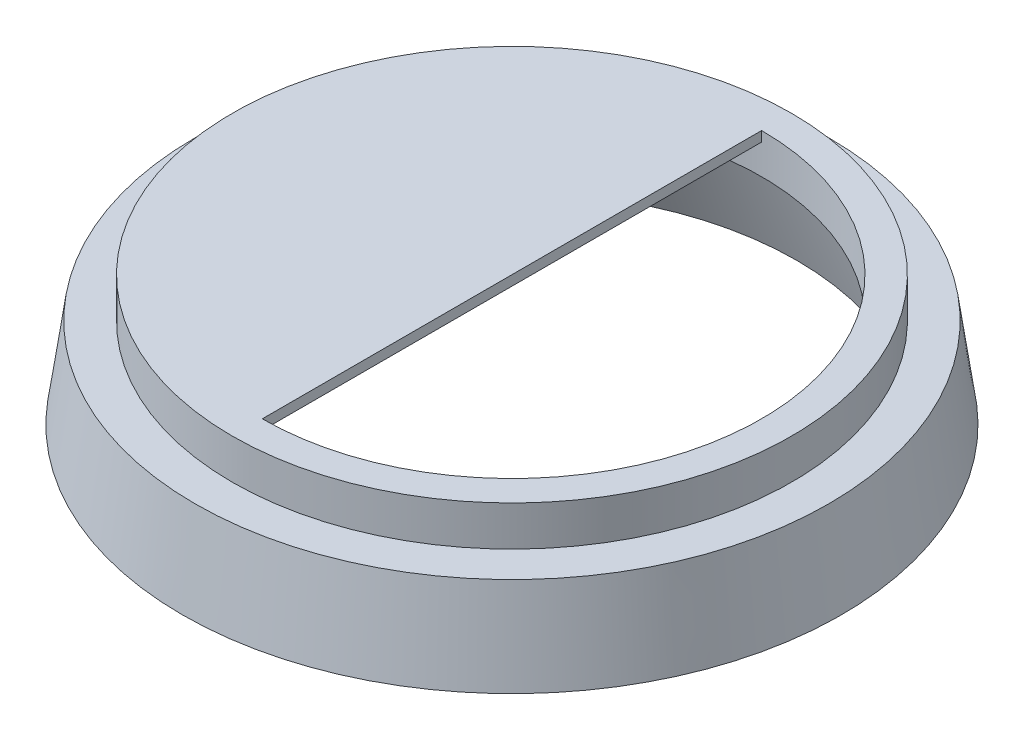
ISO-10303-21;
HEADER;
FILE_DESCRIPTION(('STEP AP214'),'2;1');
FILE_NAME('part.step','',(''),(''),'','','');
FILE_SCHEMA(('AUTOMOTIVE_DESIGN { 1 0 10303 214 1 1 1 1 }'));
ENDSEC;
DATA;
#1=APPLICATION_CONTEXT('core data for automotive mechanical design processes');
#2=APPLICATION_PROTOCOL_DEFINITION('international standard','automotive_design',2000,#1);
#3=PRODUCT_CONTEXT('',#1,'mechanical');
#4=PRODUCT('Part','Part','',(#3));
#5=PRODUCT_RELATED_PRODUCT_CATEGORY('part','',(#4));
#6=PRODUCT_DEFINITION_FORMATION('','',#4);
#7=PRODUCT_DEFINITION_CONTEXT('part definition',#1,'design');
#8=PRODUCT_DEFINITION('design','',#6,#7);
#9=PRODUCT_DEFINITION_SHAPE('','',#8);
#10=(LENGTH_UNIT() NAMED_UNIT(*) SI_UNIT(.MILLI.,.METRE.));
#11=(NAMED_UNIT(*) PLANE_ANGLE_UNIT() SI_UNIT($,.RADIAN.));
#12=(NAMED_UNIT(*) SI_UNIT($,.STERADIAN.) SOLID_ANGLE_UNIT());
#13=UNCERTAINTY_MEASURE_WITH_UNIT(LENGTH_MEASURE(1.E-05),#10,'distance_accuracy_value','');
#14=(GEOMETRIC_REPRESENTATION_CONTEXT(3) GLOBAL_UNCERTAINTY_ASSIGNED_CONTEXT((#13)) GLOBAL_UNIT_ASSIGNED_CONTEXT((#10,
#11,#12)) REPRESENTATION_CONTEXT('',''));
#15=CARTESIAN_POINT('',(0.,0.,0.));
#16=DIRECTION('',(0.,0.,1.));
#17=DIRECTION('',(1.,0.,0.));
#18=AXIS2_PLACEMENT_3D('',#15,#16,#17);
#19=CARTESIAN_POINT('',(0.,0.,0.));
#20=DIRECTION('',(0.,-1.,0.));
#21=DIRECTION('',(0.,0.,1.));
#22=AXIS2_PLACEMENT_3D('',#19,#20,#21);
#23=CONICAL_SURFACE('',#22,16.5,0.139626340159547);
#24=CARTESIAN_POINT('',(0.,0.,0.));
#25=DIRECTION('',(0.,1.,0.));
#26=DIRECTION('',(0.,0.,1.));
#27=AXIS2_PLACEMENT_3D('',#24,#25,#26);
#28=CIRCLE('',#27,16.5);
#29=CARTESIAN_POINT('',(0.,0.,16.5));
#30=VERTEX_POINT('',#29);
#31=EDGE_CURVE('E111',#30,#30,#28,.T.);
#32=ORIENTED_EDGE('',*,*,#31,.T.);
#33=EDGE_LOOP('',(#32));
#34=FACE_BOUND('',#33,.T.);
#35=CARTESIAN_POINT('',(0.,4.5,0.));
#36=DIRECTION('',(0.,1.,0.));
#37=DIRECTION('',(0.,0.,1.));
#38=AXIS2_PLACEMENT_3D('',#35,#36,#37);
#39=CIRCLE('',#38,15.8675662438392);
#40=CARTESIAN_POINT('',(0.,4.5,15.8675662438392));
#41=VERTEX_POINT('',#40);
#42=EDGE_CURVE('E43',#41,#41,#39,.T.);
#43=ORIENTED_EDGE('',*,*,#42,.F.);
#44=EDGE_LOOP('',(#43));
#45=FACE_BOUND('',#44,.T.);
#46=ADVANCED_FACE('F39',(#34,#45),#23,.T.);
#47=CARTESIAN_POINT('',(0.,6.5,0.));
#48=DIRECTION('',(0.,1.,0.));
#49=DIRECTION('',(0.,0.,1.));
#50=AXIS2_PLACEMENT_3D('',#47,#48,#49);
#51=PLANE('',#50);
#52=CARTESIAN_POINT('',(0.,6.5,0.));
#53=DIRECTION('',(0.,1.,0.));
#54=DIRECTION('',(0.,0.,1.));
#55=AXIS2_PLACEMENT_3D('',#52,#53,#54);
#56=CIRCLE('',#55,12.5);
#57=CARTESIAN_POINT('',(0.,6.5,12.5));
#58=VERTEX_POINT('',#57);
#59=CARTESIAN_POINT('',(0.,6.5,-12.5));
#60=VERTEX_POINT('',#59);
#61=EDGE_CURVE('E76',#58,#60,#56,.T.);
#62=ORIENTED_EDGE('',*,*,#61,.F.);
#63=DIRECTION('',(0.,0.,1.));
#64=VECTOR('',#63,1.);
#65=CARTESIAN_POINT('',(0.,6.5,12.5));
#66=LINE('',#65,#64);
#67=EDGE_CURVE('E86',#60,#58,#66,.T.);
#68=ORIENTED_EDGE('',*,*,#67,.F.);
#69=EDGE_LOOP('',(#62,#68));
#70=FACE_BOUND('',#69,.T.);
#71=CARTESIAN_POINT('',(0.,6.5,0.));
#72=DIRECTION('',(0.,1.,0.));
#73=DIRECTION('',(0.,0.,1.));
#74=AXIS2_PLACEMENT_3D('',#71,#72,#73);
#75=CIRCLE('',#74,14.);
#76=CARTESIAN_POINT('',(0.,6.5,14.));
#77=VERTEX_POINT('',#76);
#78=EDGE_CURVE('E99',#77,#77,#75,.T.);
#79=ORIENTED_EDGE('',*,*,#78,.T.);
#80=EDGE_LOOP('',(#79));
#81=FACE_BOUND('',#80,.T.);
#82=ADVANCED_FACE('F91',(#70,#81),#51,.T.);
#83=CARTESIAN_POINT('',(0.,0.,0.));
#84=DIRECTION('',(0.,1.,0.));
#85=DIRECTION('',(0.,0.,1.));
#86=AXIS2_PLACEMENT_3D('',#83,#84,#85);
#87=PLANE('',#86);
#88=CARTESIAN_POINT('',(0.,0.,0.));
#89=DIRECTION('',(0.,-1.,0.));
#90=DIRECTION('',(0.,0.,-1.));
#91=AXIS2_PLACEMENT_3D('',#88,#89,#90);
#92=CIRCLE('',#91,14.25);
#93=CARTESIAN_POINT('',(0.,0.,-14.25));
#94=VERTEX_POINT('',#93);
#95=EDGE_CURVE('E83',#94,#94,#92,.T.);
#96=ORIENTED_EDGE('',*,*,#95,.F.);
#97=EDGE_LOOP('',(#96));
#98=FACE_BOUND('',#97,.T.);
#99=ORIENTED_EDGE('',*,*,#31,.F.);
#100=EDGE_LOOP('',(#99));
#101=FACE_BOUND('',#100,.T.);
#102=ADVANCED_FACE('F135',(#98,#101),#87,.F.);
#103=CARTESIAN_POINT('',(0.,0.,0.));
#104=DIRECTION('',(0.,-1.,0.));
#105=DIRECTION('',(0.,0.,-1.));
#106=AXIS2_PLACEMENT_3D('',#103,#104,#105);
#107=CONICAL_SURFACE('',#106,14.25,0.36651914291881);
#108=CARTESIAN_POINT('',(0.,4.5,0.));
#109=DIRECTION('',(0.,-1.,0.));
#110=DIRECTION('',(0.,0.,-1.));
#111=AXIS2_PLACEMENT_3D('',#108,#109,#110);
#112=CIRCLE('',#111,12.5226118423406);
#113=CARTESIAN_POINT('',(0.,4.5,-12.5226118423406));
#114=VERTEX_POINT('',#113);
#115=EDGE_CURVE('E107',#114,#114,#112,.T.);
#116=ORIENTED_EDGE('',*,*,#115,.F.);
#117=EDGE_LOOP('',(#116));
#118=FACE_BOUND('',#117,.T.);
#119=ORIENTED_EDGE('',*,*,#95,.T.);
#120=EDGE_LOOP('',(#119));
#121=FACE_BOUND('',#120,.T.);
#122=ADVANCED_FACE('F129',(#118,#121),#107,.F.);
#123=CARTESIAN_POINT('',(0.,4.5,0.));
#124=DIRECTION('',(0.,-1.,0.));
#125=DIRECTION('',(0.,0.,-1.));
#126=AXIS2_PLACEMENT_3D('',#123,#124,#125);
#127=PLANE('',#126);
#128=CARTESIAN_POINT('',(0.,4.5,0.));
#129=DIRECTION('',(0.,-1.,0.));
#130=DIRECTION('',(0.,0.,-1.));
#131=AXIS2_PLACEMENT_3D('',#128,#129,#130);
#132=CIRCLE('',#131,12.5);
#133=CARTESIAN_POINT('',(-1.50000000000002,4.5,-12.4096736459909));
#134=VERTEX_POINT('',#133);
#135=CARTESIAN_POINT('',(-1.50000000000002,4.5,12.4096736459909));
#136=VERTEX_POINT('',#135);
#137=EDGE_CURVE('E55',#134,#136,#132,.T.);
#138=ORIENTED_EDGE('',*,*,#137,.F.);
#139=DIRECTION('',(0.,0.,1.));
#140=VECTOR('',#139,1.);
#141=CARTESIAN_POINT('',(-1.50000000000002,4.5,12.5));
#142=LINE('',#141,#140);
#143=EDGE_CURVE('E120',#134,#136,#142,.T.);
#144=ORIENTED_EDGE('',*,*,#143,.T.);
#145=EDGE_LOOP('',(#138,#144));
#146=FACE_BOUND('',#145,.T.);
#147=ORIENTED_EDGE('',*,*,#115,.T.);
#148=EDGE_LOOP('',(#147));
#149=FACE_BOUND('',#148,.T.);
#150=ADVANCED_FACE('F126',(#146,#149),#127,.T.);
#151=CARTESIAN_POINT('',(0.,0.5,0.));
#152=DIRECTION('',(0.,1.,0.));
#153=DIRECTION('',(0.,0.,1.));
#154=AXIS2_PLACEMENT_3D('',#151,#152,#153);
#155=CYLINDRICAL_SURFACE('',#154,12.5);
#156=ORIENTED_EDGE('',*,*,#137,.T.);
#157=CARTESIAN_POINT('',(0.,6.00000000000001,0.));
#158=DIRECTION('',(0.707106781186546,-0.707106781186549,0.));
#159=DIRECTION('',(0.707106781186549,0.707106781186546,0.));
#160=AXIS2_PLACEMENT_3D('',#157,#158,#159);
#161=ELLIPSE('',#160,17.6776695296636,12.5);
#162=CARTESIAN_POINT('',(0.,6.00000000000001,12.5));
#163=VERTEX_POINT('',#162);
#164=EDGE_CURVE('E11',#136,#163,#161,.F.);
#165=ORIENTED_EDGE('',*,*,#164,.T.);
#166=DIRECTION('',(0.,1.,0.));
#167=VECTOR('',#166,1.);
#168=CARTESIAN_POINT('',(0.,0.5,12.5));
#169=LINE('',#168,#167);
#170=EDGE_CURVE('E71',#163,#58,#169,.T.);
#171=ORIENTED_EDGE('',*,*,#170,.T.);
#172=ORIENTED_EDGE('',*,*,#61,.T.);
#173=DIRECTION('',(0.,1.,0.));
#174=VECTOR('',#173,1.);
#175=CARTESIAN_POINT('',(0.,0.5,-12.5));
#176=LINE('',#175,#174);
#177=CARTESIAN_POINT('',(0.,6.00000000000001,-12.5));
#178=VERTEX_POINT('',#177);
#179=EDGE_CURVE('E84',#178,#60,#176,.T.);
#180=ORIENTED_EDGE('',*,*,#179,.F.);
#181=CARTESIAN_POINT('',(0.,6.00000000000001,0.));
#182=DIRECTION('',(0.707106781186546,-0.707106781186549,0.));
#183=DIRECTION('',(0.707106781186549,0.707106781186546,0.));
#184=AXIS2_PLACEMENT_3D('',#181,#182,#183);
#185=ELLIPSE('',#184,17.6776695296636,12.5);
#186=EDGE_CURVE('E49',#178,#134,#185,.F.);
#187=ORIENTED_EDGE('',*,*,#186,.T.);
#188=EDGE_LOOP('',(#156,#165,#171,#172,#180,#187));
#189=FACE_BOUND('',#188,.T.);
#190=ADVANCED_FACE('F73',(#189),#155,.F.);
#191=CARTESIAN_POINT('',(0.,0.5,12.5));
#192=DIRECTION('',(-1.,0.,0.));
#193=DIRECTION('',(0.,0.,1.));
#194=AXIS2_PLACEMENT_3D('',#191,#192,#193);
#195=PLANE('',#194);
#196=ORIENTED_EDGE('',*,*,#170,.F.);
#197=DIRECTION('',(0.,0.,-1.));
#198=VECTOR('',#197,1.);
#199=CARTESIAN_POINT('',(0.,6.00000000000001,-12.5));
#200=LINE('',#199,#198);
#201=EDGE_CURVE('E117',#163,#178,#200,.T.);
#202=ORIENTED_EDGE('',*,*,#201,.T.);
#203=ORIENTED_EDGE('',*,*,#179,.T.);
#204=ORIENTED_EDGE('',*,*,#67,.T.);
#205=EDGE_LOOP('',(#196,#202,#203,#204));
#206=FACE_BOUND('',#205,.T.);
#207=ADVANCED_FACE('F87',(#206),#195,.F.);
#208=CARTESIAN_POINT('',(0.,6.00000000000001,12.5));
#209=DIRECTION('',(0.707106781186546,-0.707106781186549,0.));
#210=DIRECTION('',(0.,0.,1.));
#211=AXIS2_PLACEMENT_3D('',#208,#209,#210);
#212=PLANE('',#211);
#213=ORIENTED_EDGE('',*,*,#164,.F.);
#214=ORIENTED_EDGE('',*,*,#143,.F.);
#215=ORIENTED_EDGE('',*,*,#186,.F.);
#216=ORIENTED_EDGE('',*,*,#201,.F.);
#217=EDGE_LOOP('',(#213,#214,#215,#216));
#218=FACE_BOUND('',#217,.T.);
#219=ADVANCED_FACE('F41',(#218),#212,.T.);
#220=CARTESIAN_POINT('',(0.,4.5,0.));
#221=DIRECTION('',(0.,1.,0.));
#222=DIRECTION('',(0.,0.,1.));
#223=AXIS2_PLACEMENT_3D('',#220,#221,#222);
#224=PLANE('',#223);
#225=CARTESIAN_POINT('',(0.,4.5,0.));
#226=DIRECTION('',(0.,1.,0.));
#227=DIRECTION('',(0.,0.,1.));
#228=AXIS2_PLACEMENT_3D('',#225,#226,#227);
#229=CIRCLE('',#228,14.);
#230=CARTESIAN_POINT('',(0.,4.5,14.));
#231=VERTEX_POINT('',#230);
#232=EDGE_CURVE('E97',#231,#231,#229,.T.);
#233=ORIENTED_EDGE('',*,*,#232,.F.);
#234=EDGE_LOOP('',(#233));
#235=FACE_BOUND('',#234,.T.);
#236=ORIENTED_EDGE('',*,*,#42,.T.);
#237=EDGE_LOOP('',(#236));
#238=FACE_BOUND('',#237,.T.);
#239=ADVANCED_FACE('F148',(#235,#238),#224,.T.);
#240=CARTESIAN_POINT('',(0.,4.5,0.));
#241=DIRECTION('',(0.,1.,0.));
#242=DIRECTION('',(0.,0.,1.));
#243=AXIS2_PLACEMENT_3D('',#240,#241,#242);
#244=CYLINDRICAL_SURFACE('',#243,14.);
#245=ORIENTED_EDGE('',*,*,#232,.T.);
#246=EDGE_LOOP('',(#245));
#247=FACE_BOUND('',#246,.T.);
#248=ORIENTED_EDGE('',*,*,#78,.F.);
#249=EDGE_LOOP('',(#248));
#250=FACE_BOUND('',#249,.T.);
#251=ADVANCED_FACE('F150',(#247,#250),#244,.T.);
#252=CLOSED_SHELL('',(#46,#82,#102,#122,#150,#190,#207,#219,#239,#251));
#253=MANIFOLD_SOLID_BREP('B2',#252);
#254=ADVANCED_BREP_SHAPE_REPRESENTATION('',(#18,#253),#14);
#255=SHAPE_DEFINITION_REPRESENTATION(#9,#254);
ENDSEC;
END-ISO-10303-21;
